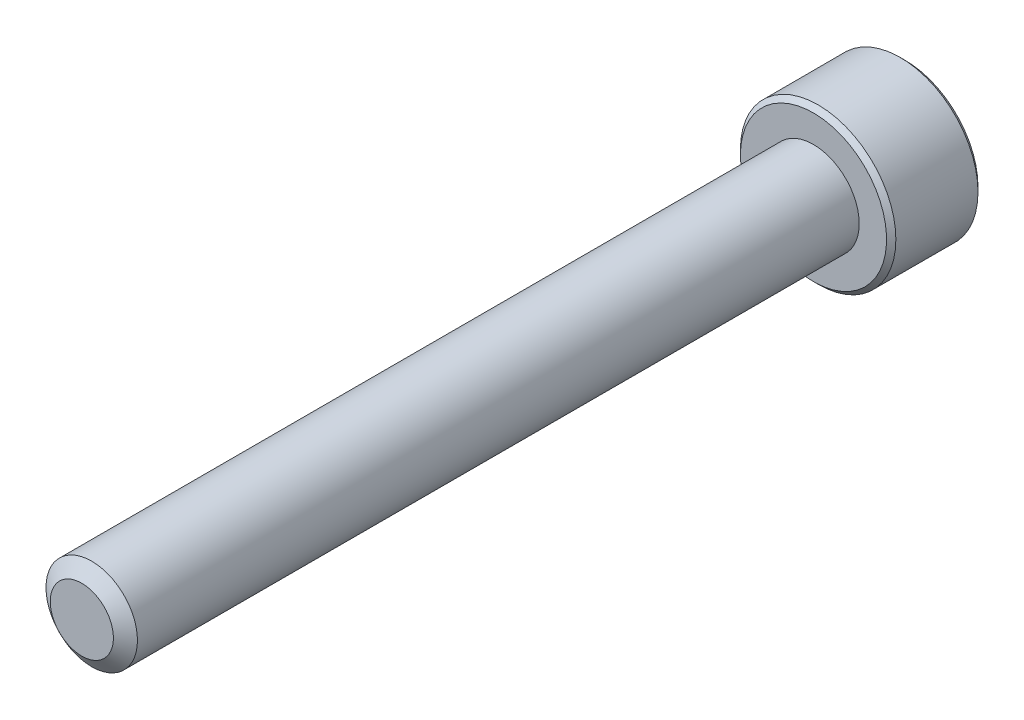
ISO-10303-21;
HEADER;
FILE_DESCRIPTION(('STEP AP214'),'2;1');
FILE_NAME('part.step','',(''),(''),'','','');
FILE_SCHEMA(('AUTOMOTIVE_DESIGN { 1 0 10303 214 1 1 1 1 }'));
ENDSEC;
DATA;
#1=APPLICATION_CONTEXT('core data for automotive mechanical design processes');
#2=APPLICATION_PROTOCOL_DEFINITION('international standard','automotive_design',2000,#1);
#3=PRODUCT_CONTEXT('',#1,'mechanical');
#4=PRODUCT('Part','Part','',(#3));
#5=PRODUCT_RELATED_PRODUCT_CATEGORY('part','',(#4));
#6=PRODUCT_DEFINITION_FORMATION('','',#4);
#7=PRODUCT_DEFINITION_CONTEXT('part definition',#1,'design');
#8=PRODUCT_DEFINITION('design','',#6,#7);
#9=PRODUCT_DEFINITION_SHAPE('','',#8);
#10=(LENGTH_UNIT() NAMED_UNIT(*) SI_UNIT(.MILLI.,.METRE.));
#11=(NAMED_UNIT(*) PLANE_ANGLE_UNIT() SI_UNIT($,.RADIAN.));
#12=(NAMED_UNIT(*) SI_UNIT($,.STERADIAN.) SOLID_ANGLE_UNIT());
#13=UNCERTAINTY_MEASURE_WITH_UNIT(LENGTH_MEASURE(1.E-05),#10,'distance_accuracy_value','');
#14=(GEOMETRIC_REPRESENTATION_CONTEXT(3) GLOBAL_UNCERTAINTY_ASSIGNED_CONTEXT((#13)) GLOBAL_UNIT_ASSIGNED_CONTEXT((#10,
#11,#12)) REPRESENTATION_CONTEXT('',''));
#15=CARTESIAN_POINT('',(0.,0.,0.));
#16=DIRECTION('',(0.,0.,1.));
#17=DIRECTION('',(1.,0.,0.));
#18=AXIS2_PLACEMENT_3D('',#15,#16,#17);
#19=CARTESIAN_POINT('',(2.,3.46410161513775,-42.));
#20=DIRECTION('',(0.,0.,-1.));
#21=DIRECTION('',(-1.,0.,0.));
#22=AXIS2_PLACEMENT_3D('',#19,#20,#21);
#23=PLANE('',#22);
#24=DIRECTION('',(0.866025403784439,-0.5,0.));
#25=VECTOR('',#24,1.);
#26=CARTESIAN_POINT('',(0.,-2.3094010767585,-42.));
#27=LINE('',#26,#25);
#28=CARTESIAN_POINT('',(0.,-2.3094010767585,-42.));
#29=VERTEX_POINT('',#28);
#30=CARTESIAN_POINT('',(-2.,-1.15470053837925,-42.));
#31=VERTEX_POINT('',#30);
#32=EDGE_CURVE('E83',#29,#31,#27,.F.);
#33=ORIENTED_EDGE('',*,*,#32,.T.);
#34=DIRECTION('',(0.,-1.,0.));
#35=VECTOR('',#34,1.);
#36=CARTESIAN_POINT('',(-2.,-1.15470053837925,-42.));
#37=LINE('',#36,#35);
#38=CARTESIAN_POINT('',(-2.,1.15470053837925,-42.));
#39=VERTEX_POINT('',#38);
#40=EDGE_CURVE('E85',#31,#39,#37,.F.);
#41=ORIENTED_EDGE('',*,*,#40,.T.);
#42=DIRECTION('',(-0.866025403784439,-0.5,0.));
#43=VECTOR('',#42,1.);
#44=CARTESIAN_POINT('',(-2.,1.15470053837925,-42.));
#45=LINE('',#44,#43);
#46=CARTESIAN_POINT('',(0.,2.3094010767585,-42.));
#47=VERTEX_POINT('',#46);
#48=EDGE_CURVE('E86',#39,#47,#45,.F.);
#49=ORIENTED_EDGE('',*,*,#48,.T.);
#50=DIRECTION('',(-0.866025403784439,0.5,0.));
#51=VECTOR('',#50,1.);
#52=CARTESIAN_POINT('',(0.,2.3094010767585,-42.));
#53=LINE('',#52,#51);
#54=CARTESIAN_POINT('',(2.,1.15470053837925,-42.));
#55=VERTEX_POINT('',#54);
#56=EDGE_CURVE('E72',#47,#55,#53,.F.);
#57=ORIENTED_EDGE('',*,*,#56,.T.);
#58=DIRECTION('',(0.,1.,0.));
#59=VECTOR('',#58,1.);
#60=CARTESIAN_POINT('',(2.,1.15470053837925,-42.));
#61=LINE('',#60,#59);
#62=CARTESIAN_POINT('',(2.,-1.15470053837925,-42.));
#63=VERTEX_POINT('',#62);
#64=EDGE_CURVE('E111',#55,#63,#61,.F.);
#65=ORIENTED_EDGE('',*,*,#64,.T.);
#66=DIRECTION('',(0.866025403784439,0.5,0.));
#67=VECTOR('',#66,1.);
#68=CARTESIAN_POINT('',(2.,-1.15470053837925,-42.));
#69=LINE('',#68,#67);
#70=EDGE_CURVE('E116',#63,#29,#69,.F.);
#71=ORIENTED_EDGE('',*,*,#70,.T.);
#72=EDGE_LOOP('',(#33,#41,#49,#57,#65,#71));
#73=FACE_BOUND('',#72,.T.);
#74=ADVANCED_FACE('F17',(#73),#23,.T.);
#75=CARTESIAN_POINT('',(-2.,1.15470053837925,-42.));
#76=DIRECTION('',(-0.5,0.866025403784439,0.));
#77=DIRECTION('',(-0.866025403784439,-0.5,0.));
#78=AXIS2_PLACEMENT_3D('',#75,#76,#77);
#79=PLANE('',#78);
#80=CARTESIAN_POINT('',(-2.00000000001087,1.15470053837298,-44.9999999999944));
#81=CARTESIAN_POINT('',(-1.93125902325549,1.19438815980705,-44.9603504659829));
#82=CARTESIAN_POINT('',(-1.86136869595778,1.23473935908614,-44.9230300003571));
#83=CARTESIAN_POINT('',(-1.71885514629469,1.31701959534729,-44.8546978210166));
#84=CARTESIAN_POINT('',(-1.64621837828898,1.35895645290845,-44.8237241148805));
#85=CARTESIAN_POINT('',(-1.49974989850729,1.4435200691382,-44.7706659478644));
#86=CARTESIAN_POINT('',(-1.42595546773178,1.48612530361114,-44.7484481632766));
#87=CARTESIAN_POINT('',(-1.27674247310371,1.57227346622625,-44.7142174344237));
#88=CARTESIAN_POINT('',(-1.20132846421658,1.6158137645579,-44.7021789477926));
#89=CARTESIAN_POINT('',(-1.07134894568569,1.69085747457085,-44.6913168403827));
#90=CARTESIAN_POINT('',(-1.01695123996845,1.72226400461,-44.6897093825432));
#91=CARTESIAN_POINT('',(-0.908244831960036,1.78502567853629,-44.6924209601814));
#92=CARTESIAN_POINT('',(-0.85393616754424,1.81638080055608,-44.6967420729479));
#93=CARTESIAN_POINT('',(-0.745831730580457,1.87879492633771,-44.7110648887028));
#94=CARTESIAN_POINT('',(-0.692036599962445,1.90985355948111,-44.7210729428679));
#95=CARTESIAN_POINT('',(-0.585376617951826,1.9714337288067,-44.7462202945426));
#96=CARTESIAN_POINT('',(-0.532511695541302,2.00195530599111,-44.7613591985273));
#97=CARTESIAN_POINT('',(-0.3971335215316,2.08011593119801,-44.8062914409309));
#98=CARTESIAN_POINT('',(-0.315458831162184,2.12727083566877,-44.8394679774583));
#99=CARTESIAN_POINT('',(-0.195362477134942,2.19660849799509,-44.8954729024819));
#100=CARTESIAN_POINT('',(-0.155785239173749,2.21945842698577,-44.9151502047749));
#101=CARTESIAN_POINT('',(-0.0773635753112238,2.26473519572709,-44.9562982810196));
#102=CARTESIAN_POINT('',(-0.0385187179474275,2.28716228458271,-44.9777679558251));
#103=CARTESIAN_POINT('',(1.08673943812926E-11,2.30940107676478,-44.9999999999944));
#104=B_SPLINE_CURVE_WITH_KNOTS('',3,(#80,#81,#82,#83,#84,#85,#86,#87,#88,#89,#90,#91,#92,#93,
#94,#95,#96,#97,#98,#99,#100,#101,#102,#103),.UNSPECIFIED.,.F.,.F.,(4,2,2,2,2,2,2,2,2,2,2,4),
(0.,0.266365893164331,0.534283082938558,0.797946653638416,1.06094664741745,1.24918072557611,
1.4374807751853,1.62599153278246,1.81448783529068,2.11378546072148,2.26302829801555,
2.41218027729746),.UNSPECIFIED.);
#105=CARTESIAN_POINT('',(-2.00000000001206,1.15470053838621,-45.000000000002));
#106=VERTEX_POINT('',#105);
#107=CARTESIAN_POINT('',(-1.8680203472892E-11,2.30940107677556,-45.0000000000051));
#108=VERTEX_POINT('',#107);
#109=EDGE_CURVE('E20',#106,#108,#104,.T.);
#110=ORIENTED_EDGE('',*,*,#109,.T.);
#111=DIRECTION('',(0.,0.,1.));
#112=VECTOR('',#111,1.);
#113=CARTESIAN_POINT('',(0.,2.3094010767585,-42.));
#114=LINE('',#113,#112);
#115=EDGE_CURVE('E91',#108,#47,#114,.T.);
#116=ORIENTED_EDGE('',*,*,#115,.T.);
#117=ORIENTED_EDGE('',*,*,#48,.F.);
#118=DIRECTION('',(0.,0.,1.));
#119=VECTOR('',#118,1.);
#120=CARTESIAN_POINT('',(-2.,1.15470053837925,-42.));
#121=LINE('',#120,#119);
#122=EDGE_CURVE('E59',#39,#106,#121,.F.);
#123=ORIENTED_EDGE('',*,*,#122,.T.);
#124=EDGE_LOOP('',(#110,#116,#117,#123));
#125=FACE_BOUND('',#124,.T.);
#126=ADVANCED_FACE('F90',(#125),#79,.F.);
#127=CARTESIAN_POINT('',(-2.,-1.15470053837925,-42.));
#128=DIRECTION('',(-1.,0.,0.));
#129=DIRECTION('',(0.,-1.,0.));
#130=AXIS2_PLACEMENT_3D('',#127,#128,#129);
#131=PLANE('',#130);
#132=CARTESIAN_POINT('',(-2.,-1.1547005383918,-44.9999999999944));
#133=CARTESIAN_POINT('',(-2.,-1.07532529552365,-44.9603504659829));
#134=CARTESIAN_POINT('',(-2.,-0.994622896965477,-44.9230300003571));
#135=CARTESIAN_POINT('',(-2.,-0.830062424443176,-44.8546978210166));
#136=CARTESIAN_POINT('',(-2.,-0.746188709320858,-44.8237241148805));
#137=CARTESIAN_POINT('',(-2.,-0.577061476861345,-44.7706659478644));
#138=CARTESIAN_POINT('',(-2.,-0.491851007915476,-44.7484481632766));
#139=CARTESIAN_POINT('',(-2.,-0.319554682685262,-44.7142174344237));
#140=CARTESIAN_POINT('',(-2.,-0.232474086021954,-44.7021789477926));
#141=CARTESIAN_POINT('',(-2.,-0.0823866659960637,-44.6913168403827));
#142=CARTESIAN_POINT('',(-2.,-0.0195736059177658,-44.6897093825432));
#143=CARTESIAN_POINT('',(-2.,0.105949741934819,-44.6924209601814));
#144=CARTESIAN_POINT('',(-2.,0.168659985974397,-44.6967420729479));
#145=CARTESIAN_POINT('',(-2.,0.293488237537662,-44.7110648887028));
#146=CARTESIAN_POINT('',(-2.,0.355605503824463,-44.7210729428679));
#147=CARTESIAN_POINT('',(-2.,0.478765842475647,-44.7462202945426));
#148=CARTESIAN_POINT('',(-2.,0.539808996844456,-44.7613591985273));
#149=CARTESIAN_POINT('',(-2.,0.696130247258259,-44.8062914409309));
#150=CARTESIAN_POINT('',(-2.,0.790440056199784,-44.8394679774583));
#151=CARTESIAN_POINT('',(-2.,0.929115380852426,-44.8954729024819));
#152=CARTESIAN_POINT('',(-2.,0.97481523883378,-44.9151502047749));
#153=CARTESIAN_POINT('',(-2.,1.06536877631643,-44.9562982810196));
#154=CARTESIAN_POINT('',(-2.,1.11022295402768,-44.9777679558251));
#155=CARTESIAN_POINT('',(-2.,1.1547005383918,-44.9999999999944));
#156=B_SPLINE_CURVE_WITH_KNOTS('',3,(#132,#133,#134,#135,#136,#137,#138,#139,#140,#141,#142,
#143,#144,#145,#146,#147,#148,#149,#150,#151,#152,#153,#154,#155),.UNSPECIFIED.,.F.,.F.,(4,2,2,
2,2,2,2,2,2,2,2,4),(0.,0.266365893164332,0.534283082938554,0.79794665363841,1.06094664741744,
1.2491807255761,1.43748077518529,1.62599153278245,1.81448783529067,2.11378546072147,
2.26302829801554,2.41218027729746),.UNSPECIFIED.);
#157=CARTESIAN_POINT('',(-2.00000000001206,-1.15470053838621,-45.000000000002));
#158=VERTEX_POINT('',#157);
#159=EDGE_CURVE('E95',#158,#106,#156,.T.);
#160=ORIENTED_EDGE('',*,*,#159,.T.);
#161=ORIENTED_EDGE('',*,*,#122,.F.);
#162=ORIENTED_EDGE('',*,*,#40,.F.);
#163=DIRECTION('',(0.,0.,1.));
#164=VECTOR('',#163,1.);
#165=CARTESIAN_POINT('',(-2.,-1.15470053837925,-42.));
#166=LINE('',#165,#164);
#167=EDGE_CURVE('E97',#31,#158,#166,.F.);
#168=ORIENTED_EDGE('',*,*,#167,.T.);
#169=EDGE_LOOP('',(#160,#161,#162,#168));
#170=FACE_BOUND('',#169,.T.);
#171=ADVANCED_FACE('F93',(#170),#131,.F.);
#172=CARTESIAN_POINT('',(0.,-2.3094010767585,-42.));
#173=DIRECTION('',(-0.5,-0.866025403784439,0.));
#174=DIRECTION('',(0.866025403784439,-0.5,0.));
#175=AXIS2_PLACEMENT_3D('',#172,#173,#174);
#176=PLANE('',#175);
#177=CARTESIAN_POINT('',(1.08690743560793E-11,-2.30940107676477,-44.9999999999944));
#178=CARTESIAN_POINT('',(-0.068740976744504,-2.2697134553307,-44.9603504659829));
#179=CARTESIAN_POINT('',(-0.13863130404222,-2.22936225605162,-44.9230300003571));
#180=CARTESIAN_POINT('',(-0.281144853705306,-2.14708201979046,-44.8546978210166));
#181=CARTESIAN_POINT('',(-0.353781621711014,-2.1051451622293,-44.8237241148805));
#182=CARTESIAN_POINT('',(-0.500250101492709,-2.02058154599955,-44.7706659478644));
#183=CARTESIAN_POINT('',(-0.574044532268217,-1.97797631152661,-44.7484481632766));
#184=CARTESIAN_POINT('',(-0.723257526896289,-1.8918281489115,-44.7142174344237));
#185=CARTESIAN_POINT('',(-0.798671535783421,-1.84828785057985,-44.7021789477925));
#186=CARTESIAN_POINT('',(-0.928651054314308,-1.7732441405669,-44.6913168403827));
#187=CARTESIAN_POINT('',(-0.983048760031552,-1.74183761052776,-44.6897093825432));
#188=CARTESIAN_POINT('',(-1.09175516803996,-1.67907593660146,-44.6924209601814));
#189=CARTESIAN_POINT('',(-1.14606383245576,-1.64772081458167,-44.6967420729479));
#190=CARTESIAN_POINT('',(-1.25416826941954,-1.58530668880004,-44.7110648887028));
#191=CARTESIAN_POINT('',(-1.30796340003755,-1.55424805565664,-44.7210729428679));
#192=CARTESIAN_POINT('',(-1.41462338204817,-1.49266788633105,-44.7462202945426));
#193=CARTESIAN_POINT('',(-1.4674883044587,-1.46214630914664,-44.7613591985273));
#194=CARTESIAN_POINT('',(-1.6028664784684,-1.38398568393974,-44.8062914409309));
#195=CARTESIAN_POINT('',(-1.68454116883782,-1.33683077946898,-44.8394679774583));
#196=CARTESIAN_POINT('',(-1.80463752286506,-1.26749311714266,-44.8954729024819));
#197=CARTESIAN_POINT('',(-1.84421476082625,-1.24464318815198,-44.9151502047749));
#198=CARTESIAN_POINT('',(-1.92263642468877,-1.19936641941066,-44.9562982810196));
#199=CARTESIAN_POINT('',(-1.96148128205257,-1.17693933055504,-44.9777679558251));
#200=CARTESIAN_POINT('',(-2.00000000001087,-1.15470053837297,-44.9999999999944));
#201=B_SPLINE_CURVE_WITH_KNOTS('',3,(#177,#178,#179,#180,#181,#182,#183,#184,#185,#186,#187,
#188,#189,#190,#191,#192,#193,#194,#195,#196,#197,#198,#199,#200),.UNSPECIFIED.,.F.,.F.,(4,2,2,
2,2,2,2,2,2,2,2,4),(0.,0.266365893164335,0.534283082938558,0.797946653638417,1.06094664741745,
1.24918072557611,1.4374807751853,1.62599153278246,1.81448783529068,2.11378546072148,
2.26302829801555,2.41218027729747),.UNSPECIFIED.);
#202=CARTESIAN_POINT('',(0.,-2.30940107677242,-45.000000000002));
#203=VERTEX_POINT('',#202);
#204=EDGE_CURVE('E199',#203,#158,#201,.T.);
#205=ORIENTED_EDGE('',*,*,#204,.T.);
#206=ORIENTED_EDGE('',*,*,#167,.F.);
#207=ORIENTED_EDGE('',*,*,#32,.F.);
#208=DIRECTION('',(0.,0.,1.));
#209=VECTOR('',#208,1.);
#210=CARTESIAN_POINT('',(0.,-2.3094010767585,-42.));
#211=LINE('',#210,#209);
#212=EDGE_CURVE('E113',#29,#203,#211,.F.);
#213=ORIENTED_EDGE('',*,*,#212,.T.);
#214=EDGE_LOOP('',(#205,#206,#207,#213));
#215=FACE_BOUND('',#214,.T.);
#216=ADVANCED_FACE('F209',(#215),#176,.F.);
#217=CARTESIAN_POINT('',(2.,-1.15470053837925,-42.));
#218=DIRECTION('',(0.5,-0.866025403784439,0.));
#219=DIRECTION('',(0.866025403784439,0.5,0.));
#220=AXIS2_PLACEMENT_3D('',#217,#218,#219);
#221=PLANE('',#220);
#222=CARTESIAN_POINT('',(2.00000000001087,-1.15470053837298,-44.9999999999944));
#223=CARTESIAN_POINT('',(1.93125902325549,-1.19438815980705,-44.9603504659829));
#224=CARTESIAN_POINT('',(1.86136869595778,-1.23473935908614,-44.9230300003571));
#225=CARTESIAN_POINT('',(1.71885514629469,-1.31701959534729,-44.8546978210166));
#226=CARTESIAN_POINT('',(1.64621837828898,-1.35895645290845,-44.8237241148805));
#227=CARTESIAN_POINT('',(1.49974989850729,-1.4435200691382,-44.7706659478644));
#228=CARTESIAN_POINT('',(1.42595546773178,-1.48612530361114,-44.7484481632766));
#229=CARTESIAN_POINT('',(1.27674247310371,-1.57227346622625,-44.7142174344237));
#230=CARTESIAN_POINT('',(1.20132846421658,-1.6158137645579,-44.7021789477926));
#231=CARTESIAN_POINT('',(1.07134894568569,-1.69085747457085,-44.6913168403827));
#232=CARTESIAN_POINT('',(1.01695123996845,-1.72226400461,-44.6897093825432));
#233=CARTESIAN_POINT('',(0.908244831960036,-1.78502567853629,-44.6924209601814));
#234=CARTESIAN_POINT('',(0.85393616754424,-1.81638080055608,-44.6967420729479));
#235=CARTESIAN_POINT('',(0.745831730580457,-1.87879492633771,-44.7110648887028));
#236=CARTESIAN_POINT('',(0.692036599962445,-1.90985355948111,-44.7210729428679));
#237=CARTESIAN_POINT('',(0.585376617951826,-1.9714337288067,-44.7462202945426));
#238=CARTESIAN_POINT('',(0.532511695541302,-2.00195530599111,-44.7613591985273));
#239=CARTESIAN_POINT('',(0.3971335215316,-2.08011593119801,-44.8062914409309));
#240=CARTESIAN_POINT('',(0.315458831162184,-2.12727083566877,-44.8394679774583));
#241=CARTESIAN_POINT('',(0.195362477134944,-2.19660849799509,-44.8954729024819));
#242=CARTESIAN_POINT('',(0.155785239173752,-2.21945842698576,-44.9151502047749));
#243=CARTESIAN_POINT('',(0.0773635753112278,-2.26473519572709,-44.9562982810196));
#244=CARTESIAN_POINT('',(0.0385187179474311,-2.28716228458271,-44.9777679558251));
#245=CARTESIAN_POINT('',(-1.08656553185394E-11,-2.30940107676477,-44.9999999999943));
#246=B_SPLINE_CURVE_WITH_KNOTS('',3,(#222,#223,#224,#225,#226,#227,#228,#229,#230,#231,#232,
#233,#234,#235,#236,#237,#238,#239,#240,#241,#242,#243,#244,#245),.UNSPECIFIED.,.F.,.F.,(4,2,2,
2,2,2,2,2,2,2,2,4),(0.,0.266365893164331,0.534283082938558,0.797946653638417,1.06094664741745,
1.24918072557611,1.4374807751853,1.62599153278246,1.81448783529068,2.11378546072148,
2.26302829801554,2.41218027729746),.UNSPECIFIED.);
#247=CARTESIAN_POINT('',(2.00000000001206,-1.15470053838621,-45.000000000002));
#248=VERTEX_POINT('',#247);
#249=EDGE_CURVE('E191',#248,#203,#246,.T.);
#250=ORIENTED_EDGE('',*,*,#249,.T.);
#251=ORIENTED_EDGE('',*,*,#212,.F.);
#252=ORIENTED_EDGE('',*,*,#70,.F.);
#253=DIRECTION('',(0.,0.,-1.));
#254=VECTOR('',#253,1.);
#255=CARTESIAN_POINT('',(2.,-1.15470053837925,-42.));
#256=LINE('',#255,#254);
#257=EDGE_CURVE('E108',#63,#248,#256,.T.);
#258=ORIENTED_EDGE('',*,*,#257,.T.);
#259=EDGE_LOOP('',(#250,#251,#252,#258));
#260=FACE_BOUND('',#259,.T.);
#261=ADVANCED_FACE('F205',(#260),#221,.F.);
#262=CARTESIAN_POINT('',(2.,1.15470053837925,-42.));
#263=DIRECTION('',(1.,0.,0.));
#264=DIRECTION('',(0.,0.,-1.));
#265=AXIS2_PLACEMENT_3D('',#262,#263,#264);
#266=PLANE('',#265);
#267=CARTESIAN_POINT('',(2.,1.1547005383918,-44.9999999999944));
#268=CARTESIAN_POINT('',(2.,1.07532529552365,-44.9603504659829));
#269=CARTESIAN_POINT('',(2.,0.994622896965476,-44.9230300003571));
#270=CARTESIAN_POINT('',(2.,0.830062424443175,-44.8546978210166));
#271=CARTESIAN_POINT('',(2.,0.746188709320857,-44.8237241148805));
#272=CARTESIAN_POINT('',(2.,0.577061476861345,-44.7706659478644));
#273=CARTESIAN_POINT('',(2.,0.491851007915476,-44.7484481632766));
#274=CARTESIAN_POINT('',(2.,0.319554682685262,-44.7142174344237));
#275=CARTESIAN_POINT('',(2.,0.232474086021956,-44.7021789477926));
#276=CARTESIAN_POINT('',(2.,0.0823866659960668,-44.6913168403827));
#277=CARTESIAN_POINT('',(2.,0.019573605917769,-44.6897093825432));
#278=CARTESIAN_POINT('',(2.,-0.105949741934816,-44.6924209601814));
#279=CARTESIAN_POINT('',(2.,-0.168659985974394,-44.6967420729479));
#280=CARTESIAN_POINT('',(2.,-0.29348823753766,-44.7110648887028));
#281=CARTESIAN_POINT('',(2.,-0.355605503824461,-44.7210729428679));
#282=CARTESIAN_POINT('',(2.,-0.478765842475644,-44.7462202945426));
#283=CARTESIAN_POINT('',(2.,-0.539808996844453,-44.7613591985273));
#284=CARTESIAN_POINT('',(2.,-0.696130247258257,-44.8062914409309));
#285=CARTESIAN_POINT('',(2.,-0.790440056199782,-44.8394679774583));
#286=CARTESIAN_POINT('',(2.,-0.929115380852424,-44.8954729024819));
#287=CARTESIAN_POINT('',(2.,-0.974815238833777,-44.9151502047749));
#288=CARTESIAN_POINT('',(2.,-1.06536877631643,-44.9562982810196));
#289=CARTESIAN_POINT('',(2.,-1.11022295402767,-44.9777679558251));
#290=CARTESIAN_POINT('',(2.,-1.1547005383918,-44.9999999999944));
#291=B_SPLINE_CURVE_WITH_KNOTS('',3,(#267,#268,#269,#270,#271,#272,#273,#274,#275,#276,#277,
#278,#279,#280,#281,#282,#283,#284,#285,#286,#287,#288,#289,#290),.UNSPECIFIED.,.F.,.F.,(4,2,2,
2,2,2,2,2,2,2,2,4),(0.,0.266365893164332,0.534283082938555,0.79794665363841,1.06094664741744,
1.2491807255761,1.43748077518529,1.62599153278245,1.81448783529067,2.11378546072147,
2.26302829801554,2.41218027729746),.UNSPECIFIED.);
#292=CARTESIAN_POINT('',(2.00000000001206,1.15470053838621,-45.000000000002));
#293=VERTEX_POINT('',#292);
#294=EDGE_CURVE('E161',#293,#248,#291,.T.);
#295=ORIENTED_EDGE('',*,*,#294,.T.);
#296=ORIENTED_EDGE('',*,*,#257,.F.);
#297=ORIENTED_EDGE('',*,*,#64,.F.);
#298=DIRECTION('',(0.,0.,1.));
#299=VECTOR('',#298,1.);
#300=CARTESIAN_POINT('',(2.,1.15470053837925,-42.));
#301=LINE('',#300,#299);
#302=EDGE_CURVE('E40',#55,#293,#301,.F.);
#303=ORIENTED_EDGE('',*,*,#302,.T.);
#304=EDGE_LOOP('',(#295,#296,#297,#303));
#305=FACE_BOUND('',#304,.T.);
#306=ADVANCED_FACE('F208',(#305),#266,.F.);
#307=CARTESIAN_POINT('',(0.,2.3094010767585,-42.));
#308=DIRECTION('',(0.5,0.866025403784439,0.));
#309=DIRECTION('',(-0.866025403784439,0.5,0.));
#310=AXIS2_PLACEMENT_3D('',#307,#308,#309);
#311=PLANE('',#310);
#312=CARTESIAN_POINT('',(-1.08672522022084E-11,2.30940107676477,-44.9999999999943));
#313=CARTESIAN_POINT('',(0.0687409767445071,2.2697134553307,-44.9603504659829));
#314=CARTESIAN_POINT('',(0.138631304042223,2.22936225605161,-44.9230300003571));
#315=CARTESIAN_POINT('',(0.281144853705308,2.14708201979046,-44.8546978210166));
#316=CARTESIAN_POINT('',(0.353781621711016,2.1051451622293,-44.8237241148805));
#317=CARTESIAN_POINT('',(0.50025010149271,2.02058154599955,-44.7706659478644));
#318=CARTESIAN_POINT('',(0.574044532268218,1.97797631152661,-44.7484481632766));
#319=CARTESIAN_POINT('',(0.723257526896289,1.8918281489115,-44.7142174344237));
#320=CARTESIAN_POINT('',(0.798671535783419,1.84828785057985,-44.7021789477926));
#321=CARTESIAN_POINT('',(0.928651054314305,1.77324414056691,-44.6913168403827));
#322=CARTESIAN_POINT('',(0.983048760031549,1.74183761052776,-44.6897093825432));
#323=CARTESIAN_POINT('',(1.09175516803996,1.67907593660146,-44.6924209601814));
#324=CARTESIAN_POINT('',(1.14606383245575,1.64772081458168,-44.6967420729479));
#325=CARTESIAN_POINT('',(1.25416826941954,1.58530668880004,-44.7110648887028));
#326=CARTESIAN_POINT('',(1.30796340003755,1.55424805565664,-44.7210729428679));
#327=CARTESIAN_POINT('',(1.41462338204817,1.49266788633105,-44.7462202945426));
#328=CARTESIAN_POINT('',(1.46748830445869,1.46214630914665,-44.7613591985273));
#329=CARTESIAN_POINT('',(1.60286647846839,1.38398568393975,-44.8062914409309));
#330=CARTESIAN_POINT('',(1.68454116883781,1.33683077946898,-44.8394679774583));
#331=CARTESIAN_POINT('',(1.80463752286506,1.26749311714266,-44.8954729024819));
#332=CARTESIAN_POINT('',(1.84421476082625,1.24464318815198,-44.9151502047749));
#333=CARTESIAN_POINT('',(1.92263642468877,1.19936641941066,-44.9562982810196));
#334=CARTESIAN_POINT('',(1.96148128205257,1.17693933055504,-44.9777679558251));
#335=CARTESIAN_POINT('',(2.00000000001087,1.15470053837298,-44.9999999999944));
#336=B_SPLINE_CURVE_WITH_KNOTS('',3,(#312,#313,#314,#315,#316,#317,#318,#319,#320,#321,#322,
#323,#324,#325,#326,#327,#328,#329,#330,#331,#332,#333,#334,#335),.UNSPECIFIED.,.F.,.F.,(4,2,2,
2,2,2,2,2,2,2,2,4),(0.,0.266365893164333,0.534283082938555,0.797946653638411,1.06094664741744,
1.2491807255761,1.43748077518529,1.62599153278245,1.81448783529067,2.11378546072147,
2.26302829801554,2.41218027729746),.UNSPECIFIED.);
#337=EDGE_CURVE('E153',#108,#293,#336,.T.);
#338=ORIENTED_EDGE('',*,*,#337,.T.);
#339=ORIENTED_EDGE('',*,*,#302,.F.);
#340=ORIENTED_EDGE('',*,*,#56,.F.);
#341=ORIENTED_EDGE('',*,*,#115,.F.);
#342=EDGE_LOOP('',(#338,#339,#340,#341));
#343=FACE_BOUND('',#342,.T.);
#344=ADVANCED_FACE('F169',(#343),#311,.F.);
#345=CARTESIAN_POINT('',(0.,0.,-44.9999999999591));
#346=DIRECTION('',(0.,0.,-1.));
#347=DIRECTION('',(-1.,0.,0.));
#348=AXIS2_PLACEMENT_3D('',#345,#346,#347);
#349=CONICAL_SURFACE('',#348,2.3094010767295,0.785398163397448);
#350=ORIENTED_EDGE('',*,*,#109,.F.);
#351=CARTESIAN_POINT('',(0.,0.,-45.0000000000159));
#352=DIRECTION('',(0.,0.,-1.));
#353=DIRECTION('',(-1.,0.,0.));
#354=AXIS2_PLACEMENT_3D('',#351,#352,#353);
#355=CIRCLE('',#354,2.30940107678634);
#356=EDGE_CURVE('E150',#108,#106,#355,.F.);
#357=ORIENTED_EDGE('',*,*,#356,.F.);
#358=EDGE_LOOP('',(#350,#357));
#359=FACE_BOUND('',#358,.T.);
#360=ADVANCED_FACE('F226',(#359),#349,.F.);
#361=CARTESIAN_POINT('',(0.,0.,-44.9999999999591));
#362=DIRECTION('',(0.,0.,-1.));
#363=DIRECTION('',(-1.,0.,0.));
#364=AXIS2_PLACEMENT_3D('',#361,#362,#363);
#365=CONICAL_SURFACE('',#364,2.3094010767295,0.785398163397448);
#366=CARTESIAN_POINT('',(0.,0.,-45.0000000000159));
#367=DIRECTION('',(0.,0.,-1.));
#368=DIRECTION('',(-1.,0.,0.));
#369=AXIS2_PLACEMENT_3D('',#366,#367,#368);
#370=CIRCLE('',#369,2.30940107678634);
#371=EDGE_CURVE('E147',#106,#158,#370,.F.);
#372=ORIENTED_EDGE('',*,*,#371,.F.);
#373=ORIENTED_EDGE('',*,*,#159,.F.);
#374=EDGE_LOOP('',(#372,#373));
#375=FACE_BOUND('',#374,.T.);
#376=ADVANCED_FACE('F223',(#375),#365,.F.);
#377=CARTESIAN_POINT('',(0.,0.,-44.9999999999591));
#378=DIRECTION('',(0.,0.,-1.));
#379=DIRECTION('',(-1.,0.,0.));
#380=AXIS2_PLACEMENT_3D('',#377,#378,#379);
#381=CONICAL_SURFACE('',#380,2.3094010767295,0.785398163397448);
#382=ORIENTED_EDGE('',*,*,#204,.F.);
#383=CARTESIAN_POINT('',(0.,0.,-45.0000000000159));
#384=DIRECTION('',(0.,0.,-1.));
#385=DIRECTION('',(-1.,0.,0.));
#386=AXIS2_PLACEMENT_3D('',#383,#384,#385);
#387=CIRCLE('',#386,2.30940107678634);
#388=EDGE_CURVE('E144',#158,#203,#387,.F.);
#389=ORIENTED_EDGE('',*,*,#388,.F.);
#390=EDGE_LOOP('',(#382,#389));
#391=FACE_BOUND('',#390,.T.);
#392=ADVANCED_FACE('F187',(#391),#381,.F.);
#393=CARTESIAN_POINT('',(0.,0.,-44.9999999999591));
#394=DIRECTION('',(0.,0.,-1.));
#395=DIRECTION('',(-1.,0.,0.));
#396=AXIS2_PLACEMENT_3D('',#393,#394,#395);
#397=CONICAL_SURFACE('',#396,2.3094010767295,0.785398163397448);
#398=ORIENTED_EDGE('',*,*,#249,.F.);
#399=CARTESIAN_POINT('',(0.,0.,-45.0000000000159));
#400=DIRECTION('',(0.,0.,-1.));
#401=DIRECTION('',(-1.,0.,0.));
#402=AXIS2_PLACEMENT_3D('',#399,#400,#401);
#403=CIRCLE('',#402,2.30940107678634);
#404=EDGE_CURVE('E141',#203,#248,#403,.F.);
#405=ORIENTED_EDGE('',*,*,#404,.F.);
#406=EDGE_LOOP('',(#398,#405));
#407=FACE_BOUND('',#406,.T.);
#408=ADVANCED_FACE('F182',(#407),#397,.F.);
#409=CARTESIAN_POINT('',(0.,0.,-44.9999999999591));
#410=DIRECTION('',(0.,0.,-1.));
#411=DIRECTION('',(-1.,0.,0.));
#412=AXIS2_PLACEMENT_3D('',#409,#410,#411);
#413=CONICAL_SURFACE('',#412,2.3094010767295,0.785398163397448);
#414=ORIENTED_EDGE('',*,*,#294,.F.);
#415=CARTESIAN_POINT('',(0.,0.,-45.0000000000159));
#416=DIRECTION('',(0.,0.,-1.));
#417=DIRECTION('',(-1.,0.,0.));
#418=AXIS2_PLACEMENT_3D('',#415,#416,#417);
#419=CIRCLE('',#418,2.30940107678634);
#420=EDGE_CURVE('E138',#248,#293,#419,.F.);
#421=ORIENTED_EDGE('',*,*,#420,.F.);
#422=EDGE_LOOP('',(#414,#421));
#423=FACE_BOUND('',#422,.T.);
#424=ADVANCED_FACE('F176',(#423),#413,.F.);
#425=CARTESIAN_POINT('',(0.,0.,-44.9999999999591));
#426=DIRECTION('',(0.,0.,-1.));
#427=DIRECTION('',(-1.,0.,0.));
#428=AXIS2_PLACEMENT_3D('',#425,#426,#427);
#429=CONICAL_SURFACE('',#428,2.3094010767295,0.785398163397448);
#430=ORIENTED_EDGE('',*,*,#337,.F.);
#431=CARTESIAN_POINT('',(0.,0.,-45.0000000000159));
#432=DIRECTION('',(0.,0.,-1.));
#433=DIRECTION('',(-1.,0.,0.));
#434=AXIS2_PLACEMENT_3D('',#431,#432,#433);
#435=CIRCLE('',#434,2.30940107678634);
#436=EDGE_CURVE('E135',#293,#108,#435,.F.);
#437=ORIENTED_EDGE('',*,*,#436,.F.);
#438=EDGE_LOOP('',(#430,#437));
#439=FACE_BOUND('',#438,.T.);
#440=ADVANCED_FACE('F171',(#439),#429,.F.);
#441=CARTESIAN_POINT('',(0.,0.,-45.));
#442=DIRECTION('',(0.,0.,-1.));
#443=DIRECTION('',(-1.,0.,0.));
#444=AXIS2_PLACEMENT_3D('',#441,#442,#443);
#445=PLANE('',#444);
#446=ORIENTED_EDGE('',*,*,#420,.T.);
#447=ORIENTED_EDGE('',*,*,#436,.T.);
#448=ORIENTED_EDGE('',*,*,#356,.T.);
#449=ORIENTED_EDGE('',*,*,#371,.T.);
#450=ORIENTED_EDGE('',*,*,#388,.T.);
#451=ORIENTED_EDGE('',*,*,#404,.T.);
#452=EDGE_LOOP('',(#446,#447,#448,#449,#450,#451));
#453=FACE_BOUND('',#452,.T.);
#454=CARTESIAN_POINT('',(0.,0.,-45.0000000000159));
#455=DIRECTION('',(0.,0.,1.));
#456=DIRECTION('',(1.,0.,0.));
#457=AXIS2_PLACEMENT_3D('',#454,#455,#456);
#458=CIRCLE('',#457,3.99499999997488);
#459=CARTESIAN_POINT('',(3.99499999997488,0.,-45.0000000000159));
#460=VERTEX_POINT('',#459);
#461=EDGE_CURVE('E131',#460,#460,#458,.T.);
#462=ORIENTED_EDGE('',*,*,#461,.F.);
#463=EDGE_LOOP('',(#462));
#464=FACE_BOUND('',#463,.T.);
#465=ADVANCED_FACE('F175',(#453,#464),#445,.T.);
#466=CARTESIAN_POINT('',(0.,0.,-44.7450000000913));
#467=DIRECTION('',(0.,0.,1.));
#468=DIRECTION('',(1.,0.,0.));
#469=AXIS2_PLACEMENT_3D('',#466,#467,#468);
#470=CONICAL_SURFACE('',#469,4.2499999998995,0.785398163397448);
#471=ORIENTED_EDGE('',*,*,#461,.T.);
#472=EDGE_LOOP('',(#471));
#473=FACE_BOUND('',#472,.T.);
#474=CARTESIAN_POINT('',(0.,0.,-44.745));
#475=DIRECTION('',(0.,0.,1.));
#476=DIRECTION('',(1.,0.,0.));
#477=AXIS2_PLACEMENT_3D('',#474,#475,#476);
#478=CIRCLE('',#477,4.25);
#479=CARTESIAN_POINT('',(4.25,0.,-44.745));
#480=VERTEX_POINT('',#479);
#481=EDGE_CURVE('E134',#480,#480,#478,.T.);
#482=ORIENTED_EDGE('',*,*,#481,.F.);
#483=EDGE_LOOP('',(#482));
#484=FACE_BOUND('',#483,.T.);
#485=ADVANCED_FACE('F262',(#473,#484),#470,.T.);
#486=CARTESIAN_POINT('',(0.,0.,-45.));
#487=DIRECTION('',(0.,0.,1.));
#488=DIRECTION('',(1.,0.,0.));
#489=AXIS2_PLACEMENT_3D('',#486,#487,#488);
#490=CYLINDRICAL_SURFACE('',#489,4.25);
#491=ORIENTED_EDGE('',*,*,#481,.T.);
#492=EDGE_LOOP('',(#491));
#493=FACE_BOUND('',#492,.T.);
#494=CARTESIAN_POINT('',(0.,0.,-40.2550000000019));
#495=DIRECTION('',(0.,0.,-1.));
#496=DIRECTION('',(-1.,0.,0.));
#497=AXIS2_PLACEMENT_3D('',#494,#495,#496);
#498=CIRCLE('',#497,4.25000000001319);
#499=CARTESIAN_POINT('',(-4.25000000001319,0.,-40.2550000000019));
#500=VERTEX_POINT('',#499);
#501=EDGE_CURVE('E130',#500,#500,#498,.F.);
#502=ORIENTED_EDGE('',*,*,#501,.F.);
#503=EDGE_LOOP('',(#502));
#504=FACE_BOUND('',#503,.T.);
#505=ADVANCED_FACE('F259',(#493,#504),#490,.T.);
#506=CARTESIAN_POINT('',(0.,0.,0.));
#507=DIRECTION('',(0.,0.,1.));
#508=DIRECTION('',(1.,0.,0.));
#509=AXIS2_PLACEMENT_3D('',#506,#507,#508);
#510=PLANE('',#509);
#511=CARTESIAN_POINT('',(0.,0.,-2.27608730474227E-11));
#512=DIRECTION('',(0.,0.,-1.));
#513=DIRECTION('',(-1.,0.,0.));
#514=AXIS2_PLACEMENT_3D('',#511,#512,#513);
#515=CIRCLE('',#514,1.72638475766007);
#516=CARTESIAN_POINT('',(-1.72638475766007,0.,-2.27608730474227E-11));
#517=VERTEX_POINT('',#516);
#518=EDGE_CURVE('E127',#517,#517,#515,.T.);
#519=ORIENTED_EDGE('',*,*,#518,.F.);
#520=EDGE_LOOP('',(#519));
#521=FACE_BOUND('',#520,.T.);
#522=ADVANCED_FACE('F255',(#521),#510,.T.);
#523=CARTESIAN_POINT('',(0.,0.,-40.2550000000019));
#524=DIRECTION('',(0.,0.,-1.));
#525=DIRECTION('',(-1.,0.,0.));
#526=AXIS2_PLACEMENT_3D('',#523,#524,#525);
#527=CONICAL_SURFACE('',#526,4.25000000001319,0.785398163397448);
#528=CARTESIAN_POINT('',(0.,0.,-39.9999999999636));
#529=DIRECTION('',(0.,0.,-1.));
#530=DIRECTION('',(-1.,0.,0.));
#531=AXIS2_PLACEMENT_3D('',#528,#529,#530);
#532=CIRCLE('',#531,3.99499999997488);
#533=CARTESIAN_POINT('',(-3.99499999997488,0.,-39.9999999999636));
#534=VERTEX_POINT('',#533);
#535=EDGE_CURVE('E124',#534,#534,#532,.T.);
#536=ORIENTED_EDGE('',*,*,#535,.T.);
#537=EDGE_LOOP('',(#536));
#538=FACE_BOUND('',#537,.T.);
#539=ORIENTED_EDGE('',*,*,#501,.T.);
#540=EDGE_LOOP('',(#539));
#541=FACE_BOUND('',#540,.T.);
#542=ADVANCED_FACE('F251',(#538,#541),#527,.T.);
#543=CARTESIAN_POINT('',(0.,0.,-0.541691224327678));
#544=DIRECTION('',(0.,0.,-1.));
#545=DIRECTION('',(-1.,0.,0.));
#546=AXIS2_PLACEMENT_3D('',#543,#544,#545);
#547=CONICAL_SURFACE('',#546,2.49999999994088,0.959931088609057);
#548=ORIENTED_EDGE('',*,*,#518,.T.);
#549=EDGE_LOOP('',(#548));
#550=FACE_BOUND('',#549,.T.);
#551=CARTESIAN_POINT('',(0.,0.,-0.541691224311844));
#552=DIRECTION('',(0.,0.,1.));
#553=DIRECTION('',(1.,0.,0.));
#554=AXIS2_PLACEMENT_3D('',#551,#552,#553);
#555=CIRCLE('',#554,2.5);
#556=CARTESIAN_POINT('',(2.5,0.,-0.541691224311844));
#557=VERTEX_POINT('',#556);
#558=EDGE_CURVE('E31',#557,#557,#555,.F.);
#559=ORIENTED_EDGE('',*,*,#558,.F.);
#560=EDGE_LOOP('',(#559));
#561=FACE_BOUND('',#560,.T.);
#562=ADVANCED_FACE('F244',(#550,#561),#547,.T.);
#563=CARTESIAN_POINT('',(0.,0.,-40.));
#564=DIRECTION('',(0.,0.,-1.));
#565=DIRECTION('',(-1.,0.,0.));
#566=AXIS2_PLACEMENT_3D('',#563,#564,#565);
#567=PLANE('',#566);
#568=CARTESIAN_POINT('',(0.,0.,-40.));
#569=DIRECTION('',(0.,0.,1.));
#570=DIRECTION('',(1.,0.,0.));
#571=AXIS2_PLACEMENT_3D('',#568,#569,#570);
#572=CIRCLE('',#571,2.5);
#573=CARTESIAN_POINT('',(2.5,0.,-40.));
#574=VERTEX_POINT('',#573);
#575=EDGE_CURVE('E11',#574,#574,#572,.T.);
#576=ORIENTED_EDGE('',*,*,#575,.F.);
#577=EDGE_LOOP('',(#576));
#578=FACE_BOUND('',#577,.T.);
#579=ORIENTED_EDGE('',*,*,#535,.F.);
#580=EDGE_LOOP('',(#579));
#581=FACE_BOUND('',#580,.T.);
#582=ADVANCED_FACE('F238',(#578,#581),#567,.F.);
#583=CARTESIAN_POINT('',(0.,0.,-40.));
#584=DIRECTION('',(0.,0.,1.));
#585=DIRECTION('',(1.,0.,0.));
#586=AXIS2_PLACEMENT_3D('',#583,#584,#585);
#587=CYLINDRICAL_SURFACE('',#586,2.5);
#588=ORIENTED_EDGE('',*,*,#575,.T.);
#589=EDGE_LOOP('',(#588));
#590=FACE_BOUND('',#589,.T.);
#591=ORIENTED_EDGE('',*,*,#558,.T.);
#592=EDGE_LOOP('',(#591));
#593=FACE_BOUND('',#592,.T.);
#594=ADVANCED_FACE('F236',(#590,#593),#587,.T.);
#595=CLOSED_SHELL('',(#74,#126,#171,#216,#261,#306,#344,#360,#376,#392,#408,#424,#440,#465,#485,
#505,#522,#542,#562,#582,#594));
#596=MANIFOLD_SOLID_BREP('B1',#595);
#597=ADVANCED_BREP_SHAPE_REPRESENTATION('',(#18,#596),#14);
#598=SHAPE_DEFINITION_REPRESENTATION(#9,#597);
ENDSEC;
END-ISO-10303-21;
